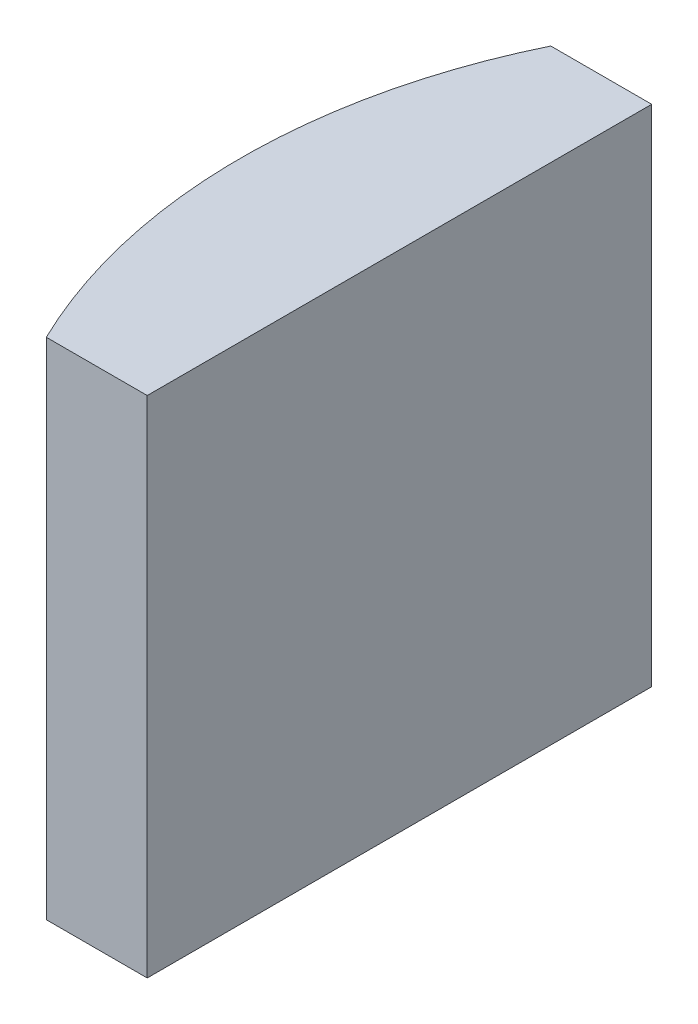
ISO-10303-21;
HEADER;
FILE_DESCRIPTION(('STEP AP214'),'2;1');
FILE_NAME('part.step','',(''),(''),'','','');
FILE_SCHEMA(('AUTOMOTIVE_DESIGN { 1 0 10303 214 1 1 1 1 }'));
ENDSEC;
DATA;
#1=APPLICATION_CONTEXT('core data for automotive mechanical design processes');
#2=APPLICATION_PROTOCOL_DEFINITION('international standard','automotive_design',2000,#1);
#3=PRODUCT_CONTEXT('',#1,'mechanical');
#4=PRODUCT('Part','Part','',(#3));
#5=PRODUCT_RELATED_PRODUCT_CATEGORY('part','',(#4));
#6=PRODUCT_DEFINITION_FORMATION('','',#4);
#7=PRODUCT_DEFINITION_CONTEXT('part definition',#1,'design');
#8=PRODUCT_DEFINITION('design','',#6,#7);
#9=PRODUCT_DEFINITION_SHAPE('','',#8);
#10=(LENGTH_UNIT() NAMED_UNIT(*) SI_UNIT(.MILLI.,.METRE.));
#11=(NAMED_UNIT(*) PLANE_ANGLE_UNIT() SI_UNIT($,.RADIAN.));
#12=(NAMED_UNIT(*) SI_UNIT($,.STERADIAN.) SOLID_ANGLE_UNIT());
#13=UNCERTAINTY_MEASURE_WITH_UNIT(LENGTH_MEASURE(1.E-05),#10,'distance_accuracy_value','');
#14=(GEOMETRIC_REPRESENTATION_CONTEXT(3) GLOBAL_UNCERTAINTY_ASSIGNED_CONTEXT((#13)) GLOBAL_UNIT_ASSIGNED_CONTEXT((#10,
#11,#12)) REPRESENTATION_CONTEXT('',''));
#15=CARTESIAN_POINT('',(0.,0.,0.));
#16=DIRECTION('',(0.,0.,1.));
#17=DIRECTION('',(1.,0.,0.));
#18=AXIS2_PLACEMENT_3D('',#15,#16,#17);
#19=CARTESIAN_POINT('',(4.35520433485127,10.,0.));
#20=DIRECTION('',(0.,-1.,0.));
#21=DIRECTION('',(0.,0.,-1.));
#22=AXIS2_PLACEMENT_3D('',#19,#20,#21);
#23=CYLINDRICAL_SURFACE('',#22,11.45);
#24=CARTESIAN_POINT('',(4.35520433485127,0.,0.));
#25=DIRECTION('',(0.,1.,0.));
#26=DIRECTION('',(0.,0.,1.));
#27=AXIS2_PLACEMENT_3D('',#24,#25,#26);
#28=CIRCLE('',#27,11.45);
#29=CARTESIAN_POINT('',(-5.94540244339243,0.,-5.));
#30=VERTEX_POINT('',#29);
#31=CARTESIAN_POINT('',(-5.94540244339243,0.,5.));
#32=VERTEX_POINT('',#31);
#33=EDGE_CURVE('E100',#30,#32,#28,.T.);
#34=ORIENTED_EDGE('',*,*,#33,.T.);
#35=DIRECTION('',(0.,-1.,0.));
#36=VECTOR('',#35,1.);
#37=CARTESIAN_POINT('',(-5.94540244339243,10.,5.));
#38=LINE('',#37,#36);
#39=CARTESIAN_POINT('',(-5.94540244339243,10.,5.));
#40=VERTEX_POINT('',#39);
#41=EDGE_CURVE('E11',#40,#32,#38,.T.);
#42=ORIENTED_EDGE('',*,*,#41,.F.);
#43=CARTESIAN_POINT('',(4.35520433485127,10.,0.));
#44=DIRECTION('',(0.,1.,0.));
#45=DIRECTION('',(0.,0.,1.));
#46=AXIS2_PLACEMENT_3D('',#43,#44,#45);
#47=CIRCLE('',#46,11.45);
#48=CARTESIAN_POINT('',(-5.94540244339243,10.,-5.));
#49=VERTEX_POINT('',#48);
#50=EDGE_CURVE('E88',#49,#40,#47,.T.);
#51=ORIENTED_EDGE('',*,*,#50,.F.);
#52=DIRECTION('',(0.,-1.,0.));
#53=VECTOR('',#52,1.);
#54=CARTESIAN_POINT('',(-5.94540244339243,10.,-5.));
#55=LINE('',#54,#53);
#56=EDGE_CURVE('E96',#49,#30,#55,.T.);
#57=ORIENTED_EDGE('',*,*,#56,.T.);
#58=EDGE_LOOP('',(#34,#42,#51,#57));
#59=FACE_BOUND('',#58,.T.);
#60=ADVANCED_FACE('F37',(#59),#23,.T.);
#61=CARTESIAN_POINT('',(-5.94540244339243,10.,5.));
#62=DIRECTION('',(0.,0.,-1.));
#63=DIRECTION('',(-1.,0.,0.));
#64=AXIS2_PLACEMENT_3D('',#61,#62,#63);
#65=PLANE('',#64);
#66=DIRECTION('',(1.,0.,0.));
#67=VECTOR('',#66,1.);
#68=CARTESIAN_POINT('',(-5.94540244339243,0.,5.));
#69=LINE('',#68,#67);
#70=CARTESIAN_POINT('',(-3.94479566514873,0.,5.));
#71=VERTEX_POINT('',#70);
#72=EDGE_CURVE('E92',#32,#71,#69,.T.);
#73=ORIENTED_EDGE('',*,*,#72,.T.);
#74=DIRECTION('',(0.,-1.,0.));
#75=VECTOR('',#74,1.);
#76=CARTESIAN_POINT('',(-3.94479566514873,10.,5.));
#77=LINE('',#76,#75);
#78=CARTESIAN_POINT('',(-3.94479566514873,10.,5.));
#79=VERTEX_POINT('',#78);
#80=EDGE_CURVE('E45',#79,#71,#77,.T.);
#81=ORIENTED_EDGE('',*,*,#80,.F.);
#82=DIRECTION('',(1.,0.,0.));
#83=VECTOR('',#82,1.);
#84=CARTESIAN_POINT('',(-5.94540244339243,10.,5.));
#85=LINE('',#84,#83);
#86=EDGE_CURVE('E83',#40,#79,#85,.T.);
#87=ORIENTED_EDGE('',*,*,#86,.F.);
#88=ORIENTED_EDGE('',*,*,#41,.T.);
#89=EDGE_LOOP('',(#73,#81,#87,#88));
#90=FACE_BOUND('',#89,.T.);
#91=ADVANCED_FACE('F91',(#90),#65,.F.);
#92=CARTESIAN_POINT('',(-3.94479566514874,10.,-5.));
#93=DIRECTION('',(-1.,0.,0.));
#94=DIRECTION('',(0.,0.,1.));
#95=AXIS2_PLACEMENT_3D('',#92,#93,#94);
#96=PLANE('',#95);
#97=DIRECTION('',(0.,0.,-1.));
#98=VECTOR('',#97,1.);
#99=CARTESIAN_POINT('',(-3.94479566514874,0.,-5.));
#100=LINE('',#99,#98);
#101=CARTESIAN_POINT('',(-3.94479566514874,0.,-5.));
#102=VERTEX_POINT('',#101);
#103=EDGE_CURVE('E70',#71,#102,#100,.T.);
#104=ORIENTED_EDGE('',*,*,#103,.T.);
#105=DIRECTION('',(0.,-1.,0.));
#106=VECTOR('',#105,1.);
#107=CARTESIAN_POINT('',(-3.94479566514874,10.,-5.));
#108=LINE('',#107,#106);
#109=CARTESIAN_POINT('',(-3.94479566514874,10.,-5.));
#110=VERTEX_POINT('',#109);
#111=EDGE_CURVE('E93',#110,#102,#108,.T.);
#112=ORIENTED_EDGE('',*,*,#111,.F.);
#113=DIRECTION('',(0.,0.,-1.));
#114=VECTOR('',#113,1.);
#115=CARTESIAN_POINT('',(-3.94479566514874,10.,-5.));
#116=LINE('',#115,#114);
#117=EDGE_CURVE('E86',#79,#110,#116,.T.);
#118=ORIENTED_EDGE('',*,*,#117,.F.);
#119=ORIENTED_EDGE('',*,*,#80,.T.);
#120=EDGE_LOOP('',(#104,#112,#118,#119));
#121=FACE_BOUND('',#120,.T.);
#122=ADVANCED_FACE('F94',(#121),#96,.F.);
#123=CARTESIAN_POINT('',(-5.94540244339243,10.,-5.));
#124=DIRECTION('',(0.,0.,1.));
#125=DIRECTION('',(1.,0.,0.));
#126=AXIS2_PLACEMENT_3D('',#123,#124,#125);
#127=PLANE('',#126);
#128=DIRECTION('',(-1.,0.,0.));
#129=VECTOR('',#128,1.);
#130=CARTESIAN_POINT('',(-5.94540244339243,0.,-5.));
#131=LINE('',#130,#129);
#132=EDGE_CURVE('E76',#102,#30,#131,.T.);
#133=ORIENTED_EDGE('',*,*,#132,.T.);
#134=ORIENTED_EDGE('',*,*,#56,.F.);
#135=DIRECTION('',(-1.,0.,0.));
#136=VECTOR('',#135,1.);
#137=CARTESIAN_POINT('',(-5.94540244339243,10.,-5.));
#138=LINE('',#137,#136);
#139=EDGE_CURVE('E53',#110,#49,#138,.T.);
#140=ORIENTED_EDGE('',*,*,#139,.F.);
#141=ORIENTED_EDGE('',*,*,#111,.T.);
#142=EDGE_LOOP('',(#133,#134,#140,#141));
#143=FACE_BOUND('',#142,.T.);
#144=ADVANCED_FACE('F107',(#143),#127,.F.);
#145=CARTESIAN_POINT('',(4.35520433485127,10.,0.));
#146=DIRECTION('',(0.,1.,0.));
#147=DIRECTION('',(0.,0.,1.));
#148=AXIS2_PLACEMENT_3D('',#145,#146,#147);
#149=PLANE('',#148);
#150=ORIENTED_EDGE('',*,*,#50,.T.);
#151=ORIENTED_EDGE('',*,*,#86,.T.);
#152=ORIENTED_EDGE('',*,*,#117,.T.);
#153=ORIENTED_EDGE('',*,*,#139,.T.);
#154=EDGE_LOOP('',(#150,#151,#152,#153));
#155=FACE_BOUND('',#154,.T.);
#156=ADVANCED_FACE('F84',(#155),#149,.T.);
#157=CARTESIAN_POINT('',(4.35520433485127,0.,0.));
#158=DIRECTION('',(0.,1.,0.));
#159=DIRECTION('',(0.,0.,1.));
#160=AXIS2_PLACEMENT_3D('',#157,#158,#159);
#161=PLANE('',#160);
#162=ORIENTED_EDGE('',*,*,#33,.F.);
#163=ORIENTED_EDGE('',*,*,#132,.F.);
#164=ORIENTED_EDGE('',*,*,#103,.F.);
#165=ORIENTED_EDGE('',*,*,#72,.F.);
#166=EDGE_LOOP('',(#162,#163,#164,#165));
#167=FACE_BOUND('',#166,.T.);
#168=ADVANCED_FACE('F110',(#167),#161,.F.);
#169=CLOSED_SHELL('',(#60,#91,#122,#144,#156,#168));
#170=MANIFOLD_SOLID_BREP('B2',#169);
#171=ADVANCED_BREP_SHAPE_REPRESENTATION('',(#18,#170),#14);
#172=SHAPE_DEFINITION_REPRESENTATION(#9,#171);
ENDSEC;
END-ISO-10303-21;
